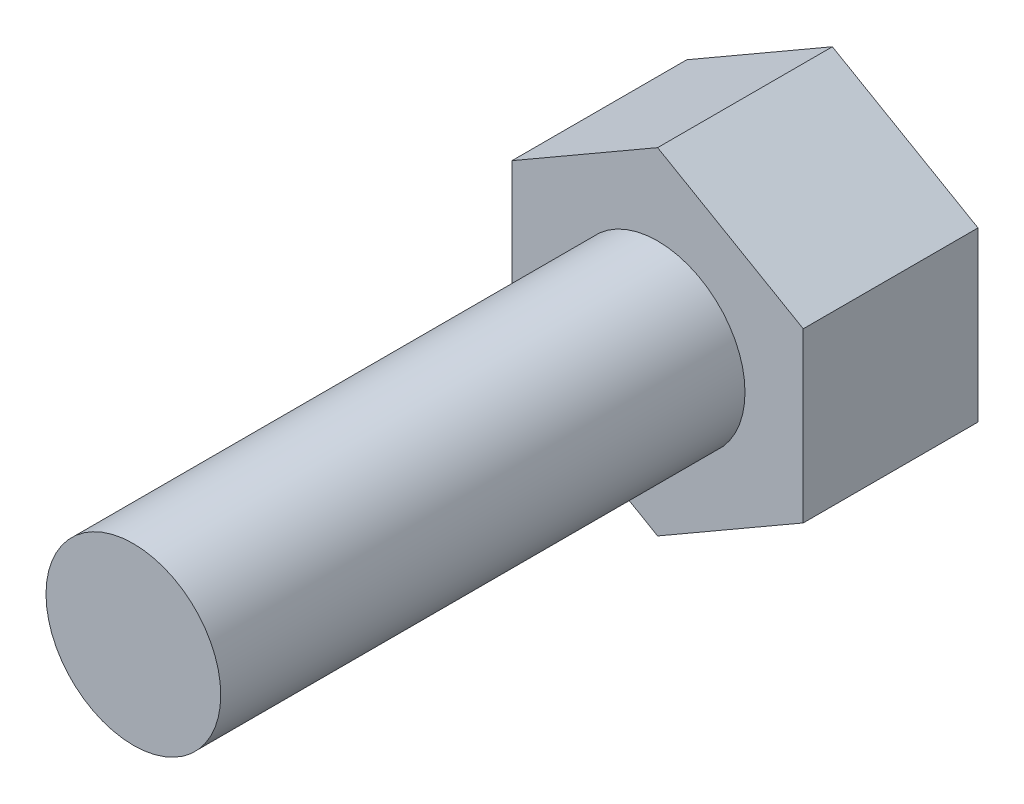
ISO-10303-21;
HEADER;
FILE_DESCRIPTION(('STEP AP214'),'2;1');
FILE_NAME('part.step','',(''),(''),'','','');
FILE_SCHEMA(('AUTOMOTIVE_DESIGN { 1 0 10303 214 1 1 1 1 }'));
ENDSEC;
DATA;
#1=APPLICATION_CONTEXT('core data for automotive mechanical design processes');
#2=APPLICATION_PROTOCOL_DEFINITION('international standard','automotive_design',2000,#1);
#3=PRODUCT_CONTEXT('',#1,'mechanical');
#4=PRODUCT('Part','Part','',(#3));
#5=PRODUCT_RELATED_PRODUCT_CATEGORY('part','',(#4));
#6=PRODUCT_DEFINITION_FORMATION('','',#4);
#7=PRODUCT_DEFINITION_CONTEXT('part definition',#1,'design');
#8=PRODUCT_DEFINITION('design','',#6,#7);
#9=PRODUCT_DEFINITION_SHAPE('','',#8);
#10=(LENGTH_UNIT() NAMED_UNIT(*) SI_UNIT(.MILLI.,.METRE.));
#11=(NAMED_UNIT(*) PLANE_ANGLE_UNIT() SI_UNIT($,.RADIAN.));
#12=(NAMED_UNIT(*) SI_UNIT($,.STERADIAN.) SOLID_ANGLE_UNIT());
#13=UNCERTAINTY_MEASURE_WITH_UNIT(LENGTH_MEASURE(1.E-05),#10,'distance_accuracy_value','');
#14=(GEOMETRIC_REPRESENTATION_CONTEXT(3) GLOBAL_UNCERTAINTY_ASSIGNED_CONTEXT((#13)) GLOBAL_UNIT_ASSIGNED_CONTEXT((#10,
#11,#12)) REPRESENTATION_CONTEXT('',''));
#15=CARTESIAN_POINT('',(0.,0.,0.));
#16=DIRECTION('',(0.,0.,1.));
#17=DIRECTION('',(1.,0.,0.));
#18=AXIS2_PLACEMENT_3D('',#15,#16,#17);
#19=CARTESIAN_POINT('',(-63.4947615904966,14.9787081339713,9.));
#20=DIRECTION('',(0.,0.,-1.));
#21=DIRECTION('',(-1.,0.,0.));
#22=AXIS2_PLACEMENT_3D('',#19,#20,#21);
#23=CYLINDRICAL_SURFACE('',#22,1.5);
#24=CARTESIAN_POINT('',(-63.4947615904966,14.9787081339713,9.));
#25=DIRECTION('',(0.,0.,1.));
#26=DIRECTION('',(1.,0.,0.));
#27=AXIS2_PLACEMENT_3D('',#24,#25,#26);
#28=CIRCLE('',#27,1.5);
#29=CARTESIAN_POINT('',(-61.9947615904966,14.9787081339713,9.));
#30=VERTEX_POINT('',#29);
#31=EDGE_CURVE('E11',#30,#30,#28,.T.);
#32=ORIENTED_EDGE('',*,*,#31,.F.);
#33=EDGE_LOOP('',(#32));
#34=FACE_BOUND('',#33,.T.);
#35=CARTESIAN_POINT('',(-63.4947615904966,14.9787081339713,0.));
#36=DIRECTION('',(0.,0.,-1.));
#37=DIRECTION('',(-1.,0.,0.));
#38=AXIS2_PLACEMENT_3D('',#35,#36,#37);
#39=CIRCLE('',#38,1.5);
#40=CARTESIAN_POINT('',(-64.9947615904966,14.9787081339713,0.));
#41=VERTEX_POINT('',#40);
#42=EDGE_CURVE('E41',#41,#41,#39,.T.);
#43=ORIENTED_EDGE('',*,*,#42,.F.);
#44=EDGE_LOOP('',(#43));
#45=FACE_BOUND('',#44,.T.);
#46=ADVANCED_FACE('F33',(#34,#45),#23,.T.);
#47=CARTESIAN_POINT('',(-63.4947615904966,14.9787081339713,9.));
#48=DIRECTION('',(0.,0.,1.));
#49=DIRECTION('',(1.,0.,0.));
#50=AXIS2_PLACEMENT_3D('',#47,#48,#49);
#51=PLANE('',#50);
#52=ORIENTED_EDGE('',*,*,#31,.T.);
#53=EDGE_LOOP('',(#52));
#54=FACE_BOUND('',#53,.T.);
#55=ADVANCED_FACE('F143',(#54),#51,.T.);
#56=CARTESIAN_POINT('',(-60.9947615904966,13.5353324609972,-3.));
#57=DIRECTION('',(-0.5,0.866025403784439,0.));
#58=DIRECTION('',(-0.866025403784439,-0.5,0.));
#59=AXIS2_PLACEMENT_3D('',#56,#57,#58);
#60=PLANE('',#59);
#61=DIRECTION('',(-0.866025403784439,-0.5,0.));
#62=VECTOR('',#61,1.);
#63=CARTESIAN_POINT('',(-60.9947615904966,13.5353324609972,0.));
#64=LINE('',#63,#62);
#65=CARTESIAN_POINT('',(-60.9947615904966,13.5353324609972,0.));
#66=VERTEX_POINT('',#65);
#67=CARTESIAN_POINT('',(-63.4947615904967,12.0919567880232,0.));
#68=VERTEX_POINT('',#67);
#69=EDGE_CURVE('E118',#66,#68,#64,.T.);
#70=ORIENTED_EDGE('',*,*,#69,.T.);
#71=DIRECTION('',(0.,0.,1.));
#72=VECTOR('',#71,1.);
#73=CARTESIAN_POINT('',(-63.4947615904967,12.0919567880232,-3.));
#74=LINE('',#73,#72);
#75=CARTESIAN_POINT('',(-63.4947615904967,12.0919567880232,-3.));
#76=VERTEX_POINT('',#75);
#77=EDGE_CURVE('E135',#76,#68,#74,.T.);
#78=ORIENTED_EDGE('',*,*,#77,.F.);
#79=DIRECTION('',(-0.866025403784439,-0.5,0.));
#80=VECTOR('',#79,1.);
#81=CARTESIAN_POINT('',(-60.9947615904966,13.5353324609972,-3.));
#82=LINE('',#81,#80);
#83=CARTESIAN_POINT('',(-60.9947615904966,13.5353324609972,-3.));
#84=VERTEX_POINT('',#83);
#85=EDGE_CURVE('E128',#84,#76,#82,.T.);
#86=ORIENTED_EDGE('',*,*,#85,.F.);
#87=DIRECTION('',(0.,0.,1.));
#88=VECTOR('',#87,1.);
#89=CARTESIAN_POINT('',(-60.9947615904966,13.5353324609972,-3.));
#90=LINE('',#89,#88);
#91=EDGE_CURVE('E114',#84,#66,#90,.T.);
#92=ORIENTED_EDGE('',*,*,#91,.T.);
#93=EDGE_LOOP('',(#70,#78,#86,#92));
#94=FACE_BOUND('',#93,.T.);
#95=ADVANCED_FACE('F148',(#94),#60,.F.);
#96=CARTESIAN_POINT('',(-63.4947615904967,12.0919567880232,-3.));
#97=DIRECTION('',(0.5,0.866025403784438,0.));
#98=DIRECTION('',(-0.866025403784438,0.5,0.));
#99=AXIS2_PLACEMENT_3D('',#96,#97,#98);
#100=PLANE('',#99);
#101=DIRECTION('',(-0.866025403784438,0.5,0.));
#102=VECTOR('',#101,1.);
#103=CARTESIAN_POINT('',(-63.4947615904967,12.0919567880232,0.));
#104=LINE('',#103,#102);
#105=CARTESIAN_POINT('',(-65.9947615904966,13.5353324609972,0.));
#106=VERTEX_POINT('',#105);
#107=EDGE_CURVE('E121',#68,#106,#104,.T.);
#108=ORIENTED_EDGE('',*,*,#107,.T.);
#109=DIRECTION('',(0.,0.,1.));
#110=VECTOR('',#109,1.);
#111=CARTESIAN_POINT('',(-65.9947615904966,13.5353324609972,-3.));
#112=LINE('',#111,#110);
#113=CARTESIAN_POINT('',(-65.9947615904966,13.5353324609972,-3.));
#114=VERTEX_POINT('',#113);
#115=EDGE_CURVE('E132',#114,#106,#112,.T.);
#116=ORIENTED_EDGE('',*,*,#115,.F.);
#117=DIRECTION('',(-0.866025403784438,0.5,0.));
#118=VECTOR('',#117,1.);
#119=CARTESIAN_POINT('',(-63.4947615904967,12.0919567880232,-3.));
#120=LINE('',#119,#118);
#121=EDGE_CURVE('E87',#76,#114,#120,.T.);
#122=ORIENTED_EDGE('',*,*,#121,.F.);
#123=ORIENTED_EDGE('',*,*,#77,.T.);
#124=EDGE_LOOP('',(#108,#116,#122,#123));
#125=FACE_BOUND('',#124,.T.);
#126=ADVANCED_FACE('F154',(#125),#100,.F.);
#127=CARTESIAN_POINT('',(-65.9947615904966,13.5353324609972,-3.));
#128=DIRECTION('',(1.,0.,0.));
#129=DIRECTION('',(0.,0.,-1.));
#130=AXIS2_PLACEMENT_3D('',#127,#128,#129);
#131=PLANE('',#130);
#132=DIRECTION('',(0.,1.,0.));
#133=VECTOR('',#132,1.);
#134=CARTESIAN_POINT('',(-65.9947615904966,13.5353324609972,0.));
#135=LINE('',#134,#133);
#136=CARTESIAN_POINT('',(-65.9947615904966,16.4220838069454,0.));
#137=VERTEX_POINT('',#136);
#138=EDGE_CURVE('E123',#106,#137,#135,.T.);
#139=ORIENTED_EDGE('',*,*,#138,.T.);
#140=DIRECTION('',(0.,0.,1.));
#141=VECTOR('',#140,1.);
#142=CARTESIAN_POINT('',(-65.9947615904966,16.4220838069454,-3.));
#143=LINE('',#142,#141);
#144=CARTESIAN_POINT('',(-65.9947615904966,16.4220838069454,-3.));
#145=VERTEX_POINT('',#144);
#146=EDGE_CURVE('E109',#145,#137,#143,.T.);
#147=ORIENTED_EDGE('',*,*,#146,.F.);
#148=DIRECTION('',(0.,1.,0.));
#149=VECTOR('',#148,1.);
#150=CARTESIAN_POINT('',(-65.9947615904966,13.5353324609972,-3.));
#151=LINE('',#150,#149);
#152=EDGE_CURVE('E100',#114,#145,#151,.T.);
#153=ORIENTED_EDGE('',*,*,#152,.F.);
#154=ORIENTED_EDGE('',*,*,#115,.T.);
#155=EDGE_LOOP('',(#139,#147,#153,#154));
#156=FACE_BOUND('',#155,.T.);
#157=ADVANCED_FACE('F160',(#156),#131,.F.);
#158=CARTESIAN_POINT('',(-65.9947615904966,16.4220838069454,-3.));
#159=DIRECTION('',(0.499999999999999,-0.866025403784439,0.));
#160=DIRECTION('',(0.866025403784439,0.499999999999999,0.));
#161=AXIS2_PLACEMENT_3D('',#158,#159,#160);
#162=PLANE('',#161);
#163=DIRECTION('',(0.866025403784439,0.499999999999999,0.));
#164=VECTOR('',#163,1.);
#165=CARTESIAN_POINT('',(-65.9947615904966,16.4220838069454,0.));
#166=LINE('',#165,#164);
#167=CARTESIAN_POINT('',(-63.4947615904966,17.8654594799194,0.));
#168=VERTEX_POINT('',#167);
#169=EDGE_CURVE('E108',#137,#168,#166,.T.);
#170=ORIENTED_EDGE('',*,*,#169,.T.);
#171=DIRECTION('',(0.,0.,1.));
#172=VECTOR('',#171,1.);
#173=CARTESIAN_POINT('',(-63.4947615904966,17.8654594799194,-3.));
#174=LINE('',#173,#172);
#175=CARTESIAN_POINT('',(-63.4947615904966,17.8654594799194,-3.));
#176=VERTEX_POINT('',#175);
#177=EDGE_CURVE('E105',#176,#168,#174,.T.);
#178=ORIENTED_EDGE('',*,*,#177,.F.);
#179=DIRECTION('',(0.866025403784439,0.499999999999999,0.));
#180=VECTOR('',#179,1.);
#181=CARTESIAN_POINT('',(-65.9947615904966,16.4220838069454,-3.));
#182=LINE('',#181,#180);
#183=EDGE_CURVE('E94',#145,#176,#182,.T.);
#184=ORIENTED_EDGE('',*,*,#183,.F.);
#185=ORIENTED_EDGE('',*,*,#146,.T.);
#186=EDGE_LOOP('',(#170,#178,#184,#185));
#187=FACE_BOUND('',#186,.T.);
#188=ADVANCED_FACE('F106',(#187),#162,.F.);
#189=CARTESIAN_POINT('',(-63.4947615904966,17.8654594799194,-3.));
#190=DIRECTION('',(-0.500000000000001,-0.866025403784438,0.));
#191=DIRECTION('',(0.866025403784438,-0.500000000000001,0.));
#192=AXIS2_PLACEMENT_3D('',#189,#190,#191);
#193=PLANE('',#192);
#194=DIRECTION('',(0.866025403784438,-0.500000000000001,0.));
#195=VECTOR('',#194,1.);
#196=CARTESIAN_POINT('',(-63.4947615904966,17.8654594799194,0.));
#197=LINE('',#196,#195);
#198=CARTESIAN_POINT('',(-60.9947615904966,16.4220838069454,0.));
#199=VERTEX_POINT('',#198);
#200=EDGE_CURVE('E72',#168,#199,#197,.T.);
#201=ORIENTED_EDGE('',*,*,#200,.T.);
#202=DIRECTION('',(0.,0.,1.));
#203=VECTOR('',#202,1.);
#204=CARTESIAN_POINT('',(-60.9947615904966,16.4220838069454,-3.));
#205=LINE('',#204,#203);
#206=CARTESIAN_POINT('',(-60.9947615904966,16.4220838069454,-3.));
#207=VERTEX_POINT('',#206);
#208=EDGE_CURVE('E110',#207,#199,#205,.T.);
#209=ORIENTED_EDGE('',*,*,#208,.F.);
#210=DIRECTION('',(0.866025403784438,-0.500000000000001,0.));
#211=VECTOR('',#210,1.);
#212=CARTESIAN_POINT('',(-63.4947615904966,17.8654594799194,-3.));
#213=LINE('',#212,#211);
#214=EDGE_CURVE('E98',#176,#207,#213,.T.);
#215=ORIENTED_EDGE('',*,*,#214,.F.);
#216=ORIENTED_EDGE('',*,*,#177,.T.);
#217=EDGE_LOOP('',(#201,#209,#215,#216));
#218=FACE_BOUND('',#217,.T.);
#219=ADVANCED_FACE('F112',(#218),#193,.F.);
#220=CARTESIAN_POINT('',(-60.9947615904966,16.4220838069454,-3.));
#221=DIRECTION('',(-1.,0.,0.));
#222=DIRECTION('',(0.,0.,1.));
#223=AXIS2_PLACEMENT_3D('',#220,#221,#222);
#224=PLANE('',#223);
#225=DIRECTION('',(0.,-1.,0.));
#226=VECTOR('',#225,1.);
#227=CARTESIAN_POINT('',(-60.9947615904966,16.4220838069454,0.));
#228=LINE('',#227,#226);
#229=EDGE_CURVE('E78',#199,#66,#228,.T.);
#230=ORIENTED_EDGE('',*,*,#229,.T.);
#231=ORIENTED_EDGE('',*,*,#91,.F.);
#232=DIRECTION('',(0.,-1.,0.));
#233=VECTOR('',#232,1.);
#234=CARTESIAN_POINT('',(-60.9947615904966,16.4220838069454,-3.));
#235=LINE('',#234,#233);
#236=EDGE_CURVE('E49',#207,#84,#235,.T.);
#237=ORIENTED_EDGE('',*,*,#236,.F.);
#238=ORIENTED_EDGE('',*,*,#208,.T.);
#239=EDGE_LOOP('',(#230,#231,#237,#238));
#240=FACE_BOUND('',#239,.T.);
#241=ADVANCED_FACE('F168',(#240),#224,.F.);
#242=CARTESIAN_POINT('',(0.,0.,-3.));
#243=DIRECTION('',(0.,0.,-1.));
#244=DIRECTION('',(-1.,0.,0.));
#245=AXIS2_PLACEMENT_3D('',#242,#243,#244);
#246=PLANE('',#245);
#247=ORIENTED_EDGE('',*,*,#85,.T.);
#248=ORIENTED_EDGE('',*,*,#121,.T.);
#249=ORIENTED_EDGE('',*,*,#152,.T.);
#250=ORIENTED_EDGE('',*,*,#183,.T.);
#251=ORIENTED_EDGE('',*,*,#214,.T.);
#252=ORIENTED_EDGE('',*,*,#236,.T.);
#253=EDGE_LOOP('',(#247,#248,#249,#250,#251,#252));
#254=FACE_BOUND('',#253,.T.);
#255=ADVANCED_FACE('F96',(#254),#246,.T.);
#256=CARTESIAN_POINT('',(0.,0.,0.));
#257=DIRECTION('',(0.,0.,-1.));
#258=DIRECTION('',(-1.,0.,0.));
#259=AXIS2_PLACEMENT_3D('',#256,#257,#258);
#260=PLANE('',#259);
#261=ORIENTED_EDGE('',*,*,#42,.T.);
#262=EDGE_LOOP('',(#261));
#263=FACE_BOUND('',#262,.T.);
#264=ORIENTED_EDGE('',*,*,#69,.F.);
#265=ORIENTED_EDGE('',*,*,#229,.F.);
#266=ORIENTED_EDGE('',*,*,#200,.F.);
#267=ORIENTED_EDGE('',*,*,#169,.F.);
#268=ORIENTED_EDGE('',*,*,#138,.F.);
#269=ORIENTED_EDGE('',*,*,#107,.F.);
#270=EDGE_LOOP('',(#264,#265,#266,#267,#268,#269));
#271=FACE_BOUND('',#270,.T.);
#272=ADVANCED_FACE('F139',(#263,#271),#260,.F.);
#273=CLOSED_SHELL('',(#46,#55,#95,#126,#157,#188,#219,#241,#255,#272));
#274=MANIFOLD_SOLID_BREP('B2',#273);
#275=ADVANCED_BREP_SHAPE_REPRESENTATION('',(#18,#274),#14);
#276=SHAPE_DEFINITION_REPRESENTATION(#9,#275);
ENDSEC;
END-ISO-10303-21;
